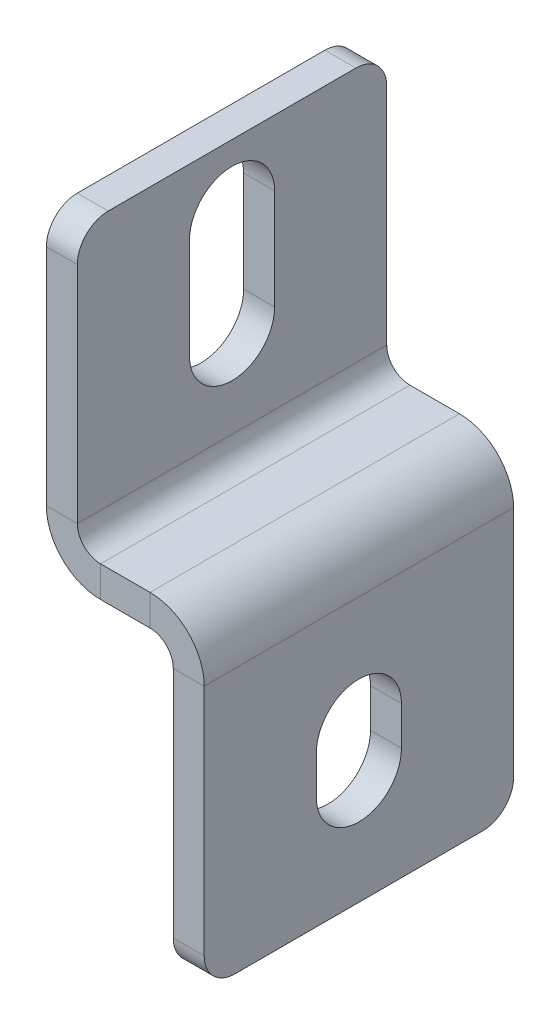
ISO-10303-21;
HEADER;
FILE_DESCRIPTION(('STEP AP214'),'2;1');
FILE_NAME('part.step','',(''),(''),'','','');
FILE_SCHEMA(('AUTOMOTIVE_DESIGN { 1 0 10303 214 1 1 1 1 }'));
ENDSEC;
DATA;
#1=APPLICATION_CONTEXT('core data for automotive mechanical design processes');
#2=APPLICATION_PROTOCOL_DEFINITION('international standard','automotive_design',2000,#1);
#3=PRODUCT_CONTEXT('',#1,'mechanical');
#4=PRODUCT('Part','Part','',(#3));
#5=PRODUCT_RELATED_PRODUCT_CATEGORY('part','',(#4));
#6=PRODUCT_DEFINITION_FORMATION('','',#4);
#7=PRODUCT_DEFINITION_CONTEXT('part definition',#1,'design');
#8=PRODUCT_DEFINITION('design','',#6,#7);
#9=PRODUCT_DEFINITION_SHAPE('','',#8);
#10=(LENGTH_UNIT() NAMED_UNIT(*) SI_UNIT(.MILLI.,.METRE.));
#11=(NAMED_UNIT(*) PLANE_ANGLE_UNIT() SI_UNIT($,.RADIAN.));
#12=(NAMED_UNIT(*) SI_UNIT($,.STERADIAN.) SOLID_ANGLE_UNIT());
#13=UNCERTAINTY_MEASURE_WITH_UNIT(LENGTH_MEASURE(1.E-05),#10,'distance_accuracy_value','');
#14=(GEOMETRIC_REPRESENTATION_CONTEXT(3) GLOBAL_UNCERTAINTY_ASSIGNED_CONTEXT((#13)) GLOBAL_UNIT_ASSIGNED_CONTEXT((#10,
#11,#12)) REPRESENTATION_CONTEXT('',''));
#15=CARTESIAN_POINT('',(0.,0.,0.));
#16=DIRECTION('',(0.,0.,1.));
#17=DIRECTION('',(1.,0.,0.));
#18=AXIS2_PLACEMENT_3D('',#15,#16,#17);
#19=CARTESIAN_POINT('',(3.56718446849537,-9.55865168971359,1.79187210233886));
#20=DIRECTION('',(0.,0.,-1.));
#21=DIRECTION('',(0.,-1.,0.));
#22=AXIS2_PLACEMENT_3D('',#19,#20,#21);
#23=PLANE('',#22);
#24=DIRECTION('',(1.,0.,0.));
#25=VECTOR('',#24,1.);
#26=CARTESIAN_POINT('',(3.56718446849537,-9.55865168971359,1.79187210233886));
#27=LINE('',#26,#25);
#28=CARTESIAN_POINT('',(1.56718446849536,-9.55865168971359,1.79187210233886));
#29=VERTEX_POINT('',#28);
#30=CARTESIAN_POINT('',(3.56718446849537,-9.55865168971359,1.79187210233886));
#31=VERTEX_POINT('',#30);
#32=EDGE_CURVE('E205',#29,#31,#27,.T.);
#33=ORIENTED_EDGE('',*,*,#32,.F.);
#34=DIRECTION('',(0.,-1.,0.));
#35=VECTOR('',#34,1.);
#36=CARTESIAN_POINT('',(1.56718446849536,3.79134831028641,1.79187210233886));
#37=LINE('',#36,#35);
#38=CARTESIAN_POINT('',(1.56718446849536,-7.05865168971359,1.79187210233886));
#39=VERTEX_POINT('',#38);
#40=EDGE_CURVE('E325',#39,#29,#37,.T.);
#41=ORIENTED_EDGE('',*,*,#40,.F.);
#42=DIRECTION('',(1.,0.,0.));
#43=VECTOR('',#42,1.);
#44=CARTESIAN_POINT('',(3.56718446849537,-7.05865168971359,1.79187210233886));
#45=LINE('',#44,#43);
#46=CARTESIAN_POINT('',(3.56718446849537,-7.05865168971359,1.79187210233886));
#47=VERTEX_POINT('',#46);
#48=EDGE_CURVE('E354',#39,#47,#45,.T.);
#49=ORIENTED_EDGE('',*,*,#48,.T.);
#50=DIRECTION('',(0.,-1.,0.));
#51=VECTOR('',#50,1.);
#52=CARTESIAN_POINT('',(3.56718446849537,-9.55865168971359,1.79187210233886));
#53=LINE('',#52,#51);
#54=EDGE_CURVE('E206',#47,#31,#53,.T.);
#55=ORIENTED_EDGE('',*,*,#54,.T.);
#56=EDGE_LOOP('',(#33,#41,#49,#55));
#57=FACE_BOUND('',#56,.T.);
#58=ADVANCED_FACE('F16',(#57),#23,.T.);
#59=CARTESIAN_POINT('',(3.56718446849537,-7.05865168971359,-0.95812789766115));
#60=DIRECTION('',(-1.,0.,0.));
#61=DIRECTION('',(0.,-1.,0.));
#62=AXIS2_PLACEMENT_3D('',#59,#60,#61);
#63=CYLINDRICAL_SURFACE('',#62,2.75);
#64=ORIENTED_EDGE('',*,*,#48,.F.);
#65=CARTESIAN_POINT('',(1.56718446849537,-7.05865168971359,-0.95812789766115));
#66=DIRECTION('',(1.,0.,0.));
#67=DIRECTION('',(0.,1.,0.));
#68=AXIS2_PLACEMENT_3D('',#65,#66,#67);
#69=CIRCLE('',#68,2.75);
#70=CARTESIAN_POINT('',(1.56718446849536,-7.05865168971359,-3.70812789766115));
#71=VERTEX_POINT('',#70);
#72=EDGE_CURVE('E311',#71,#39,#69,.T.);
#73=ORIENTED_EDGE('',*,*,#72,.F.);
#74=DIRECTION('',(1.,0.,0.));
#75=VECTOR('',#74,1.);
#76=CARTESIAN_POINT('',(3.56718446849537,-7.05865168971359,-3.70812789766115));
#77=LINE('',#76,#75);
#78=CARTESIAN_POINT('',(3.56718446849537,-7.05865168971359,-3.70812789766115));
#79=VERTEX_POINT('',#78);
#80=EDGE_CURVE('E190',#71,#79,#77,.T.);
#81=ORIENTED_EDGE('',*,*,#80,.T.);
#82=CARTESIAN_POINT('',(3.56718446849537,-7.05865168971359,-0.95812789766115));
#83=DIRECTION('',(1.,0.,0.));
#84=DIRECTION('',(0.,1.,0.));
#85=AXIS2_PLACEMENT_3D('',#82,#83,#84);
#86=CIRCLE('',#85,2.75);
#87=EDGE_CURVE('E201',#79,#47,#86,.T.);
#88=ORIENTED_EDGE('',*,*,#87,.T.);
#89=EDGE_LOOP('',(#64,#73,#81,#88));
#90=FACE_BOUND('',#89,.T.);
#91=ADVANCED_FACE('F489',(#90),#63,.F.);
#92=CARTESIAN_POINT('',(3.56718446849537,-9.55865168971359,-3.70812789766115));
#93=DIRECTION('',(0.,0.,1.));
#94=DIRECTION('',(0.,1.,0.));
#95=AXIS2_PLACEMENT_3D('',#92,#93,#94);
#96=PLANE('',#95);
#97=ORIENTED_EDGE('',*,*,#80,.F.);
#98=DIRECTION('',(0.,-1.,0.));
#99=VECTOR('',#98,1.);
#100=CARTESIAN_POINT('',(1.56718446849536,3.79134831028641,-3.70812789766115));
#101=LINE('',#100,#99);
#102=CARTESIAN_POINT('',(1.56718446849536,-9.55865168971359,-3.70812789766115));
#103=VERTEX_POINT('',#102);
#104=EDGE_CURVE('E185',#103,#71,#101,.F.);
#105=ORIENTED_EDGE('',*,*,#104,.F.);
#106=DIRECTION('',(1.,0.,0.));
#107=VECTOR('',#106,1.);
#108=CARTESIAN_POINT('',(3.56718446849536,-9.55865168971359,-3.70812789766115));
#109=LINE('',#108,#107);
#110=CARTESIAN_POINT('',(3.56718446849536,-9.55865168971359,-3.70812789766115));
#111=VERTEX_POINT('',#110);
#112=EDGE_CURVE('E179',#103,#111,#109,.T.);
#113=ORIENTED_EDGE('',*,*,#112,.T.);
#114=DIRECTION('',(0.,1.,0.));
#115=VECTOR('',#114,1.);
#116=CARTESIAN_POINT('',(3.56718446849537,-9.55865168971359,-3.70812789766115));
#117=LINE('',#116,#115);
#118=EDGE_CURVE('E182',#111,#79,#117,.T.);
#119=ORIENTED_EDGE('',*,*,#118,.T.);
#120=EDGE_LOOP('',(#97,#105,#113,#119));
#121=FACE_BOUND('',#120,.T.);
#122=ADVANCED_FACE('F181',(#121),#96,.T.);
#123=CARTESIAN_POINT('',(-4.63281553150464,3.79134831028641,9.04187210233886));
#124=DIRECTION('',(0.,0.,1.));
#125=DIRECTION('',(-1.,0.,0.));
#126=AXIS2_PLACEMENT_3D('',#123,#124,#125);
#127=PLANE('',#126);
#128=DIRECTION('',(0.,1.,0.));
#129=VECTOR('',#128,1.);
#130=CARTESIAN_POINT('',(-3.13281553150464,3.79134831028641,9.04187210233886));
#131=LINE('',#130,#129);
#132=CARTESIAN_POINT('',(-3.13281553150464,1.79134831028641,9.04187210233886));
#133=VERTEX_POINT('',#132);
#134=CARTESIAN_POINT('',(-3.13281553150464,3.79134831028641,9.04187210233886));
#135=VERTEX_POINT('',#134);
#136=EDGE_CURVE('E191',#133,#135,#131,.T.);
#137=ORIENTED_EDGE('',*,*,#136,.F.);
#138=DIRECTION('',(1.,0.,0.));
#139=VECTOR('',#138,1.);
#140=CARTESIAN_POINT('',(-4.63281553150464,1.79134831028641,9.04187210233886));
#141=LINE('',#140,#139);
#142=CARTESIAN_POINT('',(0.0671844684953576,1.79134831028641,9.04187210233886));
#143=VERTEX_POINT('',#142);
#144=EDGE_CURVE('E303',#143,#133,#141,.F.);
#145=ORIENTED_EDGE('',*,*,#144,.F.);
#146=DIRECTION('',(0.,1.,0.));
#147=VECTOR('',#146,1.);
#148=CARTESIAN_POINT('',(0.0671844684953576,3.79134831028641,9.04187210233886));
#149=LINE('',#148,#147);
#150=CARTESIAN_POINT('',(0.0671844684953576,3.79134831028641,9.04187210233886));
#151=VERTEX_POINT('',#150);
#152=EDGE_CURVE('E349',#143,#151,#149,.T.);
#153=ORIENTED_EDGE('',*,*,#152,.T.);
#154=DIRECTION('',(-1.,0.,0.));
#155=VECTOR('',#154,1.);
#156=CARTESIAN_POINT('',(-4.63281553150464,3.79134831028641,9.04187210233886));
#157=LINE('',#156,#155);
#158=EDGE_CURVE('E202',#151,#135,#157,.T.);
#159=ORIENTED_EDGE('',*,*,#158,.T.);
#160=EDGE_LOOP('',(#137,#145,#153,#159));
#161=FACE_BOUND('',#160,.T.);
#162=ADVANCED_FACE('F417',(#161),#127,.T.);
#163=CARTESIAN_POINT('',(0.0671844684953576,0.291348310286411,9.04187210233886));
#164=DIRECTION('',(0.,0.,-1.));
#165=DIRECTION('',(-1.,0.,0.));
#166=AXIS2_PLACEMENT_3D('',#163,#164,#165);
#167=PLANE('',#166);
#168=ORIENTED_EDGE('',*,*,#152,.F.);
#169=CARTESIAN_POINT('',(0.0671844684953576,0.291348310286411,9.04187210233886));
#170=DIRECTION('',(0.,0.,-1.));
#171=DIRECTION('',(-1.,0.,0.));
#172=AXIS2_PLACEMENT_3D('',#169,#170,#171);
#173=CIRCLE('',#172,1.5);
#174=CARTESIAN_POINT('',(1.56718446849536,0.291348310286412,9.04187210233886));
#175=VERTEX_POINT('',#174);
#176=EDGE_CURVE('E304',#143,#175,#173,.T.);
#177=ORIENTED_EDGE('',*,*,#176,.T.);
#178=DIRECTION('',(1.,0.,0.));
#179=VECTOR('',#178,1.);
#180=CARTESIAN_POINT('',(3.56718446849536,0.291348310286412,9.04187210233886));
#181=LINE('',#180,#179);
#182=CARTESIAN_POINT('',(3.56718446849536,0.291348310286412,9.04187210233886));
#183=VERTEX_POINT('',#182);
#184=EDGE_CURVE('E346',#175,#183,#181,.T.);
#185=ORIENTED_EDGE('',*,*,#184,.T.);
#186=CARTESIAN_POINT('',(0.0671844684953576,0.291348310286411,9.04187210233886));
#187=DIRECTION('',(0.,0.,1.));
#188=DIRECTION('',(1.,0.,0.));
#189=AXIS2_PLACEMENT_3D('',#186,#187,#188);
#190=CIRCLE('',#189,3.5);
#191=EDGE_CURVE('E248',#151,#183,#190,.F.);
#192=ORIENTED_EDGE('',*,*,#191,.F.);
#193=EDGE_LOOP('',(#168,#177,#185,#192));
#194=FACE_BOUND('',#193,.T.);
#195=ADVANCED_FACE('F450',(#194),#167,.F.);
#196=CARTESIAN_POINT('',(3.56718446849536,3.79134831028641,9.04187210233886));
#197=DIRECTION('',(0.,0.,1.));
#198=DIRECTION('',(0.,1.,0.));
#199=AXIS2_PLACEMENT_3D('',#196,#197,#198);
#200=PLANE('',#199);
#201=DIRECTION('',(0.,-1.,0.));
#202=VECTOR('',#201,1.);
#203=CARTESIAN_POINT('',(1.56718446849536,3.79134831028641,9.04187210233886));
#204=LINE('',#203,#202);
#205=CARTESIAN_POINT('',(1.56718446849536,-14.8086516897136,9.04187210233886));
#206=VERTEX_POINT('',#205);
#207=EDGE_CURVE('E310',#206,#175,#204,.F.);
#208=ORIENTED_EDGE('',*,*,#207,.F.);
#209=DIRECTION('',(-1.,0.,0.));
#210=VECTOR('',#209,1.);
#211=CARTESIAN_POINT('',(3.56718446849536,-14.8086516897136,9.04187210233886));
#212=LINE('',#211,#210);
#213=CARTESIAN_POINT('',(3.56718446849536,-14.8086516897136,9.04187210233886));
#214=VERTEX_POINT('',#213);
#215=EDGE_CURVE('E372',#206,#214,#212,.F.);
#216=ORIENTED_EDGE('',*,*,#215,.T.);
#217=DIRECTION('',(0.,1.,0.));
#218=VECTOR('',#217,1.);
#219=CARTESIAN_POINT('',(3.56718446849536,3.79134831028641,9.04187210233886));
#220=LINE('',#219,#218);
#221=EDGE_CURVE('E214',#214,#183,#220,.T.);
#222=ORIENTED_EDGE('',*,*,#221,.T.);
#223=ORIENTED_EDGE('',*,*,#184,.F.);
#224=EDGE_LOOP('',(#208,#216,#222,#223));
#225=FACE_BOUND('',#224,.T.);
#226=ADVANCED_FACE('F478',(#225),#200,.T.);
#227=CARTESIAN_POINT('',(3.56718446849536,-16.8086516897136,9.04187210233886));
#228=DIRECTION('',(0.,1.,0.));
#229=DIRECTION('',(0.,0.,-1.));
#230=AXIS2_PLACEMENT_3D('',#227,#228,#229);
#231=PLANE('',#230);
#232=DIRECTION('',(0.,0.,1.));
#233=VECTOR('',#232,1.);
#234=CARTESIAN_POINT('',(1.56718446849536,-16.8086516897136,9.04187210233886));
#235=LINE('',#234,#233);
#236=CARTESIAN_POINT('',(1.56718446849536,-16.8086516897136,7.04187210233886));
#237=VERTEX_POINT('',#236);
#238=CARTESIAN_POINT('',(1.56718446849536,-16.8086516897136,-8.95812789766115));
#239=VERTEX_POINT('',#238);
#240=EDGE_CURVE('E281',#237,#239,#235,.F.);
#241=ORIENTED_EDGE('',*,*,#240,.T.);
#242=DIRECTION('',(-1.,0.,0.));
#243=VECTOR('',#242,1.);
#244=CARTESIAN_POINT('',(3.56718446849536,-16.8086516897136,-8.95812789766115));
#245=LINE('',#244,#243);
#246=CARTESIAN_POINT('',(3.56718446849536,-16.8086516897136,-8.95812789766115));
#247=VERTEX_POINT('',#246);
#248=EDGE_CURVE('E359',#239,#247,#245,.F.);
#249=ORIENTED_EDGE('',*,*,#248,.T.);
#250=DIRECTION('',(0.,0.,-1.));
#251=VECTOR('',#250,1.);
#252=CARTESIAN_POINT('',(3.56718446849536,-16.8086516897136,9.04187210233886));
#253=LINE('',#252,#251);
#254=CARTESIAN_POINT('',(3.56718446849536,-16.8086516897136,7.04187210233886));
#255=VERTEX_POINT('',#254);
#256=EDGE_CURVE('E216',#255,#247,#253,.T.);
#257=ORIENTED_EDGE('',*,*,#256,.F.);
#258=DIRECTION('',(1.,0.,0.));
#259=VECTOR('',#258,1.);
#260=CARTESIAN_POINT('',(3.56718446849536,-16.8086516897136,7.04187210233886));
#261=LINE('',#260,#259);
#262=EDGE_CURVE('E356',#255,#237,#261,.F.);
#263=ORIENTED_EDGE('',*,*,#262,.T.);
#264=EDGE_LOOP('',(#241,#249,#257,#263));
#265=FACE_BOUND('',#264,.T.);
#266=ADVANCED_FACE('F470',(#265),#231,.F.);
#267=CARTESIAN_POINT('',(3.56718446849536,3.79134831028641,-10.9581278976611));
#268=DIRECTION('',(0.,0.,1.));
#269=DIRECTION('',(0.,1.,0.));
#270=AXIS2_PLACEMENT_3D('',#267,#268,#269);
#271=PLANE('',#270);
#272=DIRECTION('',(0.,1.,0.));
#273=VECTOR('',#272,1.);
#274=CARTESIAN_POINT('',(3.56718446849536,3.79134831028641,-10.9581278976611));
#275=LINE('',#274,#273);
#276=CARTESIAN_POINT('',(3.56718446849536,-14.8086516897136,-10.9581278976611));
#277=VERTEX_POINT('',#276);
#278=CARTESIAN_POINT('',(3.56718446849536,0.291348310286412,-10.9581278976611));
#279=VERTEX_POINT('',#278);
#280=EDGE_CURVE('E212',#277,#279,#275,.T.);
#281=ORIENTED_EDGE('',*,*,#280,.F.);
#282=DIRECTION('',(-1.,0.,0.));
#283=VECTOR('',#282,1.);
#284=CARTESIAN_POINT('',(3.56718446849536,-14.8086516897136,-10.9581278976611));
#285=LINE('',#284,#283);
#286=CARTESIAN_POINT('',(1.56718446849536,-14.8086516897136,-10.9581278976611));
#287=VERTEX_POINT('',#286);
#288=EDGE_CURVE('E366',#277,#287,#285,.T.);
#289=ORIENTED_EDGE('',*,*,#288,.T.);
#290=DIRECTION('',(0.,-1.,0.));
#291=VECTOR('',#290,1.);
#292=CARTESIAN_POINT('',(1.56718446849536,3.79134831028641,-10.9581278976611));
#293=LINE('',#292,#291);
#294=CARTESIAN_POINT('',(1.56718446849536,0.291348310286412,-10.9581278976611));
#295=VERTEX_POINT('',#294);
#296=EDGE_CURVE('E308',#287,#295,#293,.F.);
#297=ORIENTED_EDGE('',*,*,#296,.T.);
#298=DIRECTION('',(1.,0.,0.));
#299=VECTOR('',#298,1.);
#300=CARTESIAN_POINT('',(3.56718446849536,0.291348310286412,-10.9581278976611));
#301=LINE('',#300,#299);
#302=EDGE_CURVE('E343',#295,#279,#301,.T.);
#303=ORIENTED_EDGE('',*,*,#302,.T.);
#304=EDGE_LOOP('',(#281,#289,#297,#303));
#305=FACE_BOUND('',#304,.T.);
#306=ADVANCED_FACE('F459',(#305),#271,.F.);
#307=CARTESIAN_POINT('',(0.0671844684953576,0.291348310286411,-10.9581278976611));
#308=DIRECTION('',(0.,0.,1.));
#309=DIRECTION('',(1.,0.,0.));
#310=AXIS2_PLACEMENT_3D('',#307,#308,#309);
#311=PLANE('',#310);
#312=ORIENTED_EDGE('',*,*,#302,.F.);
#313=CARTESIAN_POINT('',(0.0671844684953576,0.291348310286411,-10.9581278976611));
#314=DIRECTION('',(0.,0.,-1.));
#315=DIRECTION('',(-1.,0.,0.));
#316=AXIS2_PLACEMENT_3D('',#313,#314,#315);
#317=CIRCLE('',#316,1.5);
#318=CARTESIAN_POINT('',(0.0671844684953576,1.79134831028641,-10.9581278976611));
#319=VERTEX_POINT('',#318);
#320=EDGE_CURVE('E305',#295,#319,#317,.F.);
#321=ORIENTED_EDGE('',*,*,#320,.T.);
#322=DIRECTION('',(0.,1.,0.));
#323=VECTOR('',#322,1.);
#324=CARTESIAN_POINT('',(0.0671844684953576,3.79134831028641,-10.9581278976611));
#325=LINE('',#324,#323);
#326=CARTESIAN_POINT('',(0.0671844684953576,3.79134831028641,-10.9581278976611));
#327=VERTEX_POINT('',#326);
#328=EDGE_CURVE('E341',#319,#327,#325,.T.);
#329=ORIENTED_EDGE('',*,*,#328,.T.);
#330=CARTESIAN_POINT('',(0.0671844684953576,0.291348310286411,-10.9581278976611));
#331=DIRECTION('',(0.,0.,-1.));
#332=DIRECTION('',(-1.,0.,0.));
#333=AXIS2_PLACEMENT_3D('',#330,#331,#332);
#334=CIRCLE('',#333,3.5);
#335=EDGE_CURVE('E245',#279,#327,#334,.F.);
#336=ORIENTED_EDGE('',*,*,#335,.F.);
#337=EDGE_LOOP('',(#312,#321,#329,#336));
#338=FACE_BOUND('',#337,.T.);
#339=ADVANCED_FACE('F444',(#338),#311,.F.);
#340=CARTESIAN_POINT('',(-4.63281553150464,3.79134831028641,-10.9581278976611));
#341=DIRECTION('',(0.,0.,1.));
#342=DIRECTION('',(-1.,0.,0.));
#343=AXIS2_PLACEMENT_3D('',#340,#341,#342);
#344=PLANE('',#343);
#345=ORIENTED_EDGE('',*,*,#328,.F.);
#346=DIRECTION('',(1.,0.,0.));
#347=VECTOR('',#346,1.);
#348=CARTESIAN_POINT('',(-4.63281553150464,1.79134831028641,-10.9581278976611));
#349=LINE('',#348,#347);
#350=CARTESIAN_POINT('',(-3.13281553150464,1.79134831028641,-10.9581278976611));
#351=VERTEX_POINT('',#350);
#352=EDGE_CURVE('E300',#319,#351,#349,.F.);
#353=ORIENTED_EDGE('',*,*,#352,.T.);
#354=DIRECTION('',(0.,1.,0.));
#355=VECTOR('',#354,1.);
#356=CARTESIAN_POINT('',(-3.13281553150464,3.79134831028641,-10.9581278976611));
#357=LINE('',#356,#355);
#358=CARTESIAN_POINT('',(-3.13281553150464,3.79134831028641,-10.9581278976611));
#359=VERTEX_POINT('',#358);
#360=EDGE_CURVE('E339',#351,#359,#357,.T.);
#361=ORIENTED_EDGE('',*,*,#360,.T.);
#362=DIRECTION('',(-1.,0.,0.));
#363=VECTOR('',#362,1.);
#364=CARTESIAN_POINT('',(-4.63281553150464,3.79134831028641,-10.9581278976611));
#365=LINE('',#364,#363);
#366=EDGE_CURVE('E252',#327,#359,#365,.T.);
#367=ORIENTED_EDGE('',*,*,#366,.F.);
#368=EDGE_LOOP('',(#345,#353,#361,#367));
#369=FACE_BOUND('',#368,.T.);
#370=ADVANCED_FACE('F436',(#369),#344,.F.);
#371=CARTESIAN_POINT('',(-3.13281553150464,5.29134831028641,-10.9581278976611));
#372=DIRECTION('',(0.,0.,-1.));
#373=DIRECTION('',(-1.,0.,0.));
#374=AXIS2_PLACEMENT_3D('',#371,#372,#373);
#375=PLANE('',#374);
#376=ORIENTED_EDGE('',*,*,#360,.F.);
#377=CARTESIAN_POINT('',(-3.13281553150464,5.29134831028641,-10.9581278976611));
#378=DIRECTION('',(0.,0.,1.));
#379=DIRECTION('',(1.,0.,0.));
#380=AXIS2_PLACEMENT_3D('',#377,#378,#379);
#381=CIRCLE('',#380,3.5);
#382=CARTESIAN_POINT('',(-6.63281553150464,5.29134831028641,-10.9581278976611));
#383=VERTEX_POINT('',#382);
#384=EDGE_CURVE('E296',#351,#383,#381,.F.);
#385=ORIENTED_EDGE('',*,*,#384,.T.);
#386=DIRECTION('',(1.,0.,0.));
#387=VECTOR('',#386,1.);
#388=CARTESIAN_POINT('',(-4.63281553150464,5.29134831028641,-10.9581278976611));
#389=LINE('',#388,#387);
#390=CARTESIAN_POINT('',(-4.63281553150464,5.29134831028641,-10.9581278976611));
#391=VERTEX_POINT('',#390);
#392=EDGE_CURVE('E337',#383,#391,#389,.T.);
#393=ORIENTED_EDGE('',*,*,#392,.T.);
#394=CARTESIAN_POINT('',(-3.13281553150464,5.29134831028641,-10.9581278976611));
#395=DIRECTION('',(0.,0.,1.));
#396=DIRECTION('',(1.,0.,0.));
#397=AXIS2_PLACEMENT_3D('',#394,#395,#396);
#398=CIRCLE('',#397,1.5);
#399=EDGE_CURVE('E259',#359,#391,#398,.F.);
#400=ORIENTED_EDGE('',*,*,#399,.F.);
#401=EDGE_LOOP('',(#376,#385,#393,#400));
#402=FACE_BOUND('',#401,.T.);
#403=ADVANCED_FACE('F429',(#402),#375,.T.);
#404=CARTESIAN_POINT('',(-4.63281553150464,21.7913483102864,-10.9581278976611));
#405=DIRECTION('',(0.,0.,1.));
#406=DIRECTION('',(0.,1.,0.));
#407=AXIS2_PLACEMENT_3D('',#404,#405,#406);
#408=PLANE('',#407);
#409=DIRECTION('',(0.,-1.,0.));
#410=VECTOR('',#409,1.);
#411=CARTESIAN_POINT('',(-6.63281553150464,21.7913483102864,-10.9581278976611));
#412=LINE('',#411,#410);
#413=CARTESIAN_POINT('',(-6.63281553150464,19.7913483102864,-10.9581278976611));
#414=VERTEX_POINT('',#413);
#415=EDGE_CURVE('E285',#383,#414,#412,.F.);
#416=ORIENTED_EDGE('',*,*,#415,.T.);
#417=DIRECTION('',(1.,0.,0.));
#418=VECTOR('',#417,1.);
#419=CARTESIAN_POINT('',(-4.63281553150464,19.7913483102864,-10.9581278976611));
#420=LINE('',#419,#418);
#421=CARTESIAN_POINT('',(-4.63281553150464,19.7913483102864,-10.9581278976611));
#422=VERTEX_POINT('',#421);
#423=EDGE_CURVE('E375',#414,#422,#420,.T.);
#424=ORIENTED_EDGE('',*,*,#423,.T.);
#425=DIRECTION('',(0.,1.,0.));
#426=VECTOR('',#425,1.);
#427=CARTESIAN_POINT('',(-4.63281553150464,21.7913483102864,-10.9581278976611));
#428=LINE('',#427,#426);
#429=EDGE_CURVE('E231',#391,#422,#428,.T.);
#430=ORIENTED_EDGE('',*,*,#429,.F.);
#431=ORIENTED_EDGE('',*,*,#392,.F.);
#432=EDGE_LOOP('',(#416,#424,#430,#431));
#433=FACE_BOUND('',#432,.T.);
#434=ADVANCED_FACE('F395',(#433),#408,.F.);
#435=CARTESIAN_POINT('',(-4.63281553150464,21.7913483102864,9.04187210233886));
#436=DIRECTION('',(0.,1.,0.));
#437=DIRECTION('',(0.,0.,-1.));
#438=AXIS2_PLACEMENT_3D('',#435,#436,#437);
#439=PLANE('',#438);
#440=DIRECTION('',(0.,0.,-1.));
#441=VECTOR('',#440,1.);
#442=CARTESIAN_POINT('',(-4.63281553150464,21.7913483102864,9.04187210233886));
#443=LINE('',#442,#441);
#444=CARTESIAN_POINT('',(-4.63281553150464,21.7913483102864,7.04187210233886));
#445=VERTEX_POINT('',#444);
#446=CARTESIAN_POINT('',(-4.63281553150464,21.7913483102864,-8.95812789766115));
#447=VERTEX_POINT('',#446);
#448=EDGE_CURVE('E234',#445,#447,#443,.T.);
#449=ORIENTED_EDGE('',*,*,#448,.T.);
#450=DIRECTION('',(-1.,0.,0.));
#451=VECTOR('',#450,1.);
#452=CARTESIAN_POINT('',(-4.63281553150464,21.7913483102864,-8.95812789766115));
#453=LINE('',#452,#451);
#454=CARTESIAN_POINT('',(-6.63281553150464,21.7913483102864,-8.95812789766115));
#455=VERTEX_POINT('',#454);
#456=EDGE_CURVE('E37',#447,#455,#453,.T.);
#457=ORIENTED_EDGE('',*,*,#456,.T.);
#458=DIRECTION('',(0.,0.,1.));
#459=VECTOR('',#458,1.);
#460=CARTESIAN_POINT('',(-6.63281553150464,21.7913483102864,9.04187210233886));
#461=LINE('',#460,#459);
#462=CARTESIAN_POINT('',(-6.63281553150464,21.7913483102864,7.04187210233886));
#463=VERTEX_POINT('',#462);
#464=EDGE_CURVE('E292',#463,#455,#461,.F.);
#465=ORIENTED_EDGE('',*,*,#464,.F.);
#466=DIRECTION('',(1.,0.,0.));
#467=VECTOR('',#466,1.);
#468=CARTESIAN_POINT('',(-4.63281553150464,21.7913483102864,7.04187210233886));
#469=LINE('',#468,#467);
#470=EDGE_CURVE('E382',#463,#445,#469,.T.);
#471=ORIENTED_EDGE('',*,*,#470,.T.);
#472=EDGE_LOOP('',(#449,#457,#465,#471));
#473=FACE_BOUND('',#472,.T.);
#474=ADVANCED_FACE('F401',(#473),#439,.T.);
#475=CARTESIAN_POINT('',(-4.63281553150464,21.7913483102864,9.04187210233886));
#476=DIRECTION('',(0.,0.,1.));
#477=DIRECTION('',(0.,1.,0.));
#478=AXIS2_PLACEMENT_3D('',#475,#476,#477);
#479=PLANE('',#478);
#480=DIRECTION('',(0.,1.,0.));
#481=VECTOR('',#480,1.);
#482=CARTESIAN_POINT('',(-4.63281553150464,21.7913483102864,9.04187210233886));
#483=LINE('',#482,#481);
#484=CARTESIAN_POINT('',(-4.63281553150464,5.29134831028641,9.04187210233886));
#485=VERTEX_POINT('',#484);
#486=CARTESIAN_POINT('',(-4.63281553150464,19.7913483102864,9.04187210233886));
#487=VERTEX_POINT('',#486);
#488=EDGE_CURVE('E236',#485,#487,#483,.T.);
#489=ORIENTED_EDGE('',*,*,#488,.T.);
#490=DIRECTION('',(1.,0.,0.));
#491=VECTOR('',#490,1.);
#492=CARTESIAN_POINT('',(-4.63281553150464,19.7913483102864,9.04187210233886));
#493=LINE('',#492,#491);
#494=CARTESIAN_POINT('',(-6.63281553150464,19.7913483102864,9.04187210233886));
#495=VERTEX_POINT('',#494);
#496=EDGE_CURVE('E10',#487,#495,#493,.F.);
#497=ORIENTED_EDGE('',*,*,#496,.T.);
#498=DIRECTION('',(0.,-1.,0.));
#499=VECTOR('',#498,1.);
#500=CARTESIAN_POINT('',(-6.63281553150464,21.7913483102864,9.04187210233886));
#501=LINE('',#500,#499);
#502=CARTESIAN_POINT('',(-6.63281553150464,5.29134831028641,9.04187210233886));
#503=VERTEX_POINT('',#502);
#504=EDGE_CURVE('E274',#503,#495,#501,.F.);
#505=ORIENTED_EDGE('',*,*,#504,.F.);
#506=DIRECTION('',(1.,0.,0.));
#507=VECTOR('',#506,1.);
#508=CARTESIAN_POINT('',(-4.63281553150464,5.29134831028641,9.04187210233886));
#509=LINE('',#508,#507);
#510=EDGE_CURVE('E335',#503,#485,#509,.T.);
#511=ORIENTED_EDGE('',*,*,#510,.T.);
#512=EDGE_LOOP('',(#489,#497,#505,#511));
#513=FACE_BOUND('',#512,.T.);
#514=ADVANCED_FACE('F407',(#513),#479,.T.);
#515=CARTESIAN_POINT('',(-4.63281553150464,21.7913483102864,-3.70812789766114));
#516=DIRECTION('',(0.,0.,-1.));
#517=DIRECTION('',(0.,-1.,0.));
#518=AXIS2_PLACEMENT_3D('',#515,#516,#517);
#519=PLANE('',#518);
#520=DIRECTION('',(1.,0.,0.));
#521=VECTOR('',#520,1.);
#522=CARTESIAN_POINT('',(-4.63281553150464,17.5413483102864,-3.70812789766114));
#523=LINE('',#522,#521);
#524=CARTESIAN_POINT('',(-6.63281553150464,17.5413483102864,-3.70812789766114));
#525=VERTEX_POINT('',#524);
#526=CARTESIAN_POINT('',(-4.63281553150464,17.5413483102864,-3.70812789766114));
#527=VERTEX_POINT('',#526);
#528=EDGE_CURVE('E333',#525,#527,#523,.T.);
#529=ORIENTED_EDGE('',*,*,#528,.F.);
#530=DIRECTION('',(0.,-1.,0.));
#531=VECTOR('',#530,1.);
#532=CARTESIAN_POINT('',(-6.63281553150464,21.7913483102864,-3.70812789766114));
#533=LINE('',#532,#531);
#534=CARTESIAN_POINT('',(-6.63281553150464,11.0413483102864,-3.70812789766115));
#535=VERTEX_POINT('',#534);
#536=EDGE_CURVE('E286',#525,#535,#533,.T.);
#537=ORIENTED_EDGE('',*,*,#536,.T.);
#538=DIRECTION('',(1.,0.,0.));
#539=VECTOR('',#538,1.);
#540=CARTESIAN_POINT('',(-4.63281553150464,11.0413483102864,-3.70812789766114));
#541=LINE('',#540,#539);
#542=CARTESIAN_POINT('',(-4.63281553150464,11.0413483102864,-3.70812789766114));
#543=VERTEX_POINT('',#542);
#544=EDGE_CURVE('E331',#535,#543,#541,.T.);
#545=ORIENTED_EDGE('',*,*,#544,.T.);
#546=DIRECTION('',(0.,-1.,0.));
#547=VECTOR('',#546,1.);
#548=CARTESIAN_POINT('',(-4.63281553150464,21.7913483102864,-3.70812789766114));
#549=LINE('',#548,#547);
#550=EDGE_CURVE('E225',#527,#543,#549,.T.);
#551=ORIENTED_EDGE('',*,*,#550,.F.);
#552=EDGE_LOOP('',(#529,#537,#545,#551));
#553=FACE_BOUND('',#552,.T.);
#554=ADVANCED_FACE('F658',(#553),#519,.F.);
#555=CARTESIAN_POINT('',(-4.63281553150464,11.0413483102864,-0.958127897661145));
#556=DIRECTION('',(-1.,0.,0.));
#557=DIRECTION('',(0.,-1.,0.));
#558=AXIS2_PLACEMENT_3D('',#555,#556,#557);
#559=CYLINDRICAL_SURFACE('',#558,2.75);
#560=ORIENTED_EDGE('',*,*,#544,.F.);
#561=CARTESIAN_POINT('',(-6.63281553150464,11.0413483102864,-0.958127897661145));
#562=DIRECTION('',(-1.,0.,0.));
#563=DIRECTION('',(0.,-1.,0.));
#564=AXIS2_PLACEMENT_3D('',#561,#562,#563);
#565=CIRCLE('',#564,2.75);
#566=CARTESIAN_POINT('',(-6.63281553150464,11.0413483102864,1.79187210233885));
#567=VERTEX_POINT('',#566);
#568=EDGE_CURVE('E282',#535,#567,#565,.T.);
#569=ORIENTED_EDGE('',*,*,#568,.T.);
#570=DIRECTION('',(1.,0.,0.));
#571=VECTOR('',#570,1.);
#572=CARTESIAN_POINT('',(-4.63281553150464,11.0413483102864,1.79187210233885));
#573=LINE('',#572,#571);
#574=CARTESIAN_POINT('',(-4.63281553150464,11.0413483102864,1.79187210233885));
#575=VERTEX_POINT('',#574);
#576=EDGE_CURVE('E329',#567,#575,#573,.T.);
#577=ORIENTED_EDGE('',*,*,#576,.T.);
#578=CARTESIAN_POINT('',(-4.63281553150464,11.0413483102864,-0.958127897661145));
#579=DIRECTION('',(-1.,0.,0.));
#580=DIRECTION('',(0.,-1.,0.));
#581=AXIS2_PLACEMENT_3D('',#578,#579,#580);
#582=CIRCLE('',#581,2.75);
#583=EDGE_CURVE('E228',#543,#575,#582,.T.);
#584=ORIENTED_EDGE('',*,*,#583,.F.);
#585=EDGE_LOOP('',(#560,#569,#577,#584));
#586=FACE_BOUND('',#585,.T.);
#587=ADVANCED_FACE('F648',(#586),#559,.F.);
#588=CARTESIAN_POINT('',(-4.63281553150464,21.7913483102864,1.79187210233886));
#589=DIRECTION('',(0.,0.,1.));
#590=DIRECTION('',(0.,1.,0.));
#591=AXIS2_PLACEMENT_3D('',#588,#589,#590);
#592=PLANE('',#591);
#593=ORIENTED_EDGE('',*,*,#576,.F.);
#594=DIRECTION('',(0.,-1.,0.));
#595=VECTOR('',#594,1.);
#596=CARTESIAN_POINT('',(-6.63281553150464,21.7913483102864,1.79187210233885));
#597=LINE('',#596,#595);
#598=CARTESIAN_POINT('',(-6.63281553150464,17.5413483102864,1.79187210233885));
#599=VERTEX_POINT('',#598);
#600=EDGE_CURVE('E277',#567,#599,#597,.F.);
#601=ORIENTED_EDGE('',*,*,#600,.T.);
#602=DIRECTION('',(1.,0.,0.));
#603=VECTOR('',#602,1.);
#604=CARTESIAN_POINT('',(-4.63281553150464,17.5413483102864,1.79187210233885));
#605=LINE('',#604,#603);
#606=CARTESIAN_POINT('',(-4.63281553150464,17.5413483102864,1.79187210233885));
#607=VERTEX_POINT('',#606);
#608=EDGE_CURVE('E258',#599,#607,#605,.T.);
#609=ORIENTED_EDGE('',*,*,#608,.T.);
#610=DIRECTION('',(0.,1.,0.));
#611=VECTOR('',#610,1.);
#612=CARTESIAN_POINT('',(-4.63281553150464,21.7913483102864,1.79187210233886));
#613=LINE('',#612,#611);
#614=EDGE_CURVE('E219',#575,#607,#613,.T.);
#615=ORIENTED_EDGE('',*,*,#614,.F.);
#616=EDGE_LOOP('',(#593,#601,#609,#615));
#617=FACE_BOUND('',#616,.T.);
#618=ADVANCED_FACE('F502',(#617),#592,.F.);
#619=CARTESIAN_POINT('',(3.56718446849537,-9.55865168971359,-0.95812789766115));
#620=DIRECTION('',(-1.,0.,0.));
#621=DIRECTION('',(0.,-1.,0.));
#622=AXIS2_PLACEMENT_3D('',#619,#620,#621);
#623=CYLINDRICAL_SURFACE('',#622,2.75);
#624=CARTESIAN_POINT('',(1.56718446849537,-9.55865168971359,-0.95812789766115));
#625=DIRECTION('',(1.,0.,0.));
#626=DIRECTION('',(0.,1.,0.));
#627=AXIS2_PLACEMENT_3D('',#624,#625,#626);
#628=CIRCLE('',#627,2.75);
#629=EDGE_CURVE('E322',#29,#103,#628,.T.);
#630=ORIENTED_EDGE('',*,*,#629,.F.);
#631=ORIENTED_EDGE('',*,*,#32,.T.);
#632=CARTESIAN_POINT('',(3.56718446849537,-9.55865168971359,-0.95812789766115));
#633=DIRECTION('',(1.,0.,0.));
#634=DIRECTION('',(0.,1.,0.));
#635=AXIS2_PLACEMENT_3D('',#632,#633,#634);
#636=CIRCLE('',#635,2.75);
#637=EDGE_CURVE('E198',#31,#111,#636,.T.);
#638=ORIENTED_EDGE('',*,*,#637,.T.);
#639=ORIENTED_EDGE('',*,*,#112,.F.);
#640=EDGE_LOOP('',(#630,#631,#638,#639));
#641=FACE_BOUND('',#640,.T.);
#642=ADVANCED_FACE('F204',(#641),#623,.F.);
#643=CARTESIAN_POINT('',(-4.63281553150464,17.5413483102864,-0.958127897661145));
#644=DIRECTION('',(-1.,0.,0.));
#645=DIRECTION('',(0.,-1.,0.));
#646=AXIS2_PLACEMENT_3D('',#643,#644,#645);
#647=CYLINDRICAL_SURFACE('',#646,2.75);
#648=CARTESIAN_POINT('',(-6.63281553150464,17.5413483102864,-0.958127897661145));
#649=DIRECTION('',(-1.,0.,0.));
#650=DIRECTION('',(0.,-1.,0.));
#651=AXIS2_PLACEMENT_3D('',#648,#649,#650);
#652=CIRCLE('',#651,2.75);
#653=EDGE_CURVE('E280',#599,#525,#652,.T.);
#654=ORIENTED_EDGE('',*,*,#653,.T.);
#655=ORIENTED_EDGE('',*,*,#528,.T.);
#656=CARTESIAN_POINT('',(-4.63281553150464,17.5413483102864,-0.958127897661145));
#657=DIRECTION('',(-1.,0.,0.));
#658=DIRECTION('',(0.,-1.,0.));
#659=AXIS2_PLACEMENT_3D('',#656,#657,#658);
#660=CIRCLE('',#659,2.75);
#661=EDGE_CURVE('E222',#607,#527,#660,.T.);
#662=ORIENTED_EDGE('',*,*,#661,.F.);
#663=ORIENTED_EDGE('',*,*,#608,.F.);
#664=EDGE_LOOP('',(#654,#655,#662,#663));
#665=FACE_BOUND('',#664,.T.);
#666=ADVANCED_FACE('F501',(#665),#647,.F.);
#667=CARTESIAN_POINT('',(-3.13281553150464,5.29134831028641,9.04187210233886));
#668=DIRECTION('',(0.,0.,1.));
#669=DIRECTION('',(1.,0.,0.));
#670=AXIS2_PLACEMENT_3D('',#667,#668,#669);
#671=PLANE('',#670);
#672=CARTESIAN_POINT('',(-3.13281553150464,5.29134831028641,9.04187210233886));
#673=DIRECTION('',(0.,0.,1.));
#674=DIRECTION('',(1.,0.,0.));
#675=AXIS2_PLACEMENT_3D('',#672,#673,#674);
#676=CIRCLE('',#675,3.5);
#677=EDGE_CURVE('E299',#503,#133,#676,.T.);
#678=ORIENTED_EDGE('',*,*,#677,.T.);
#679=ORIENTED_EDGE('',*,*,#136,.T.);
#680=CARTESIAN_POINT('',(-3.13281553150464,5.29134831028641,9.04187210233886));
#681=DIRECTION('',(0.,0.,-1.));
#682=DIRECTION('',(-1.,0.,0.));
#683=AXIS2_PLACEMENT_3D('',#680,#681,#682);
#684=CIRCLE('',#683,1.5);
#685=EDGE_CURVE('E249',#485,#135,#684,.F.);
#686=ORIENTED_EDGE('',*,*,#685,.F.);
#687=ORIENTED_EDGE('',*,*,#510,.F.);
#688=EDGE_LOOP('',(#678,#679,#686,#687));
#689=FACE_BOUND('',#688,.T.);
#690=ADVANCED_FACE('F410',(#689),#671,.T.);
#691=CARTESIAN_POINT('',(-4.63281553150464,21.7913483102864,9.04187210233886));
#692=DIRECTION('',(-1.,0.,0.));
#693=DIRECTION('',(0.,-1.,0.));
#694=AXIS2_PLACEMENT_3D('',#691,#692,#693);
#695=PLANE('',#694);
#696=ORIENTED_EDGE('',*,*,#614,.T.);
#697=ORIENTED_EDGE('',*,*,#661,.T.);
#698=ORIENTED_EDGE('',*,*,#550,.T.);
#699=ORIENTED_EDGE('',*,*,#583,.T.);
#700=EDGE_LOOP('',(#696,#697,#698,#699));
#701=FACE_BOUND('',#700,.T.);
#702=ORIENTED_EDGE('',*,*,#429,.T.);
#703=CARTESIAN_POINT('',(-4.63281553150464,19.7913483102864,-8.95812789766114));
#704=DIRECTION('',(-1.,0.,0.));
#705=DIRECTION('',(0.,-1.,0.));
#706=AXIS2_PLACEMENT_3D('',#703,#704,#705);
#707=CIRCLE('',#706,2.);
#708=EDGE_CURVE('E380',#422,#447,#707,.F.);
#709=ORIENTED_EDGE('',*,*,#708,.T.);
#710=ORIENTED_EDGE('',*,*,#448,.F.);
#711=CARTESIAN_POINT('',(-4.63281553150464,19.7913483102864,7.04187210233886));
#712=DIRECTION('',(-1.,0.,0.));
#713=DIRECTION('',(0.,-1.,0.));
#714=AXIS2_PLACEMENT_3D('',#711,#712,#713);
#715=CIRCLE('',#714,2.);
#716=EDGE_CURVE('E378',#445,#487,#715,.F.);
#717=ORIENTED_EDGE('',*,*,#716,.T.);
#718=ORIENTED_EDGE('',*,*,#488,.F.);
#719=DIRECTION('',(0.,0.,-1.));
#720=VECTOR('',#719,1.);
#721=CARTESIAN_POINT('',(-4.63281553150464,5.29134831028641,-10.9581278976611));
#722=LINE('',#721,#720);
#723=EDGE_CURVE('E244',#485,#391,#722,.T.);
#724=ORIENTED_EDGE('',*,*,#723,.T.);
#725=EDGE_LOOP('',(#702,#709,#710,#717,#718,#724));
#726=FACE_BOUND('',#725,.T.);
#727=ADVANCED_FACE('F400',(#701,#726),#695,.F.);
#728=CARTESIAN_POINT('',(3.56718446849536,3.79134831028641,9.04187210233886));
#729=DIRECTION('',(-1.,0.,0.));
#730=DIRECTION('',(0.,-1.,0.));
#731=AXIS2_PLACEMENT_3D('',#728,#729,#730);
#732=PLANE('',#731);
#733=ORIENTED_EDGE('',*,*,#118,.F.);
#734=ORIENTED_EDGE('',*,*,#637,.F.);
#735=ORIENTED_EDGE('',*,*,#54,.F.);
#736=ORIENTED_EDGE('',*,*,#87,.F.);
#737=EDGE_LOOP('',(#733,#734,#735,#736));
#738=FACE_BOUND('',#737,.T.);
#739=ORIENTED_EDGE('',*,*,#256,.T.);
#740=CARTESIAN_POINT('',(3.56718446849536,-14.8086516897136,-8.95812789766115));
#741=DIRECTION('',(-1.,0.,0.));
#742=DIRECTION('',(0.,-1.,0.));
#743=AXIS2_PLACEMENT_3D('',#740,#741,#742);
#744=CIRCLE('',#743,2.);
#745=EDGE_CURVE('E364',#247,#277,#744,.F.);
#746=ORIENTED_EDGE('',*,*,#745,.T.);
#747=ORIENTED_EDGE('',*,*,#280,.T.);
#748=DIRECTION('',(0.,0.,-1.));
#749=VECTOR('',#748,1.);
#750=CARTESIAN_POINT('',(3.56718446849536,0.291348310286411,9.04187210233886));
#751=LINE('',#750,#749);
#752=EDGE_CURVE('E241',#279,#183,#751,.F.);
#753=ORIENTED_EDGE('',*,*,#752,.T.);
#754=ORIENTED_EDGE('',*,*,#221,.F.);
#755=CARTESIAN_POINT('',(3.56718446849536,-14.8086516897136,7.04187210233886));
#756=DIRECTION('',(-1.,0.,0.));
#757=DIRECTION('',(0.,-1.,0.));
#758=AXIS2_PLACEMENT_3D('',#755,#756,#757);
#759=CIRCLE('',#758,2.);
#760=EDGE_CURVE('E362',#214,#255,#759,.F.);
#761=ORIENTED_EDGE('',*,*,#760,.T.);
#762=EDGE_LOOP('',(#739,#746,#747,#753,#754,#761));
#763=FACE_BOUND('',#762,.T.);
#764=ADVANCED_FACE('F195',(#738,#763),#732,.F.);
#765=CARTESIAN_POINT('',(-4.63281553150464,3.79134831028641,9.04187210233886));
#766=DIRECTION('',(0.,-1.,0.));
#767=DIRECTION('',(0.,0.,-1.));
#768=AXIS2_PLACEMENT_3D('',#765,#766,#767);
#769=PLANE('',#768);
#770=ORIENTED_EDGE('',*,*,#366,.T.);
#771=DIRECTION('',(0.,0.,-1.));
#772=VECTOR('',#771,1.);
#773=CARTESIAN_POINT('',(-3.13281553150464,3.79134831028641,9.04187210233886));
#774=LINE('',#773,#772);
#775=EDGE_CURVE('E255',#359,#135,#774,.F.);
#776=ORIENTED_EDGE('',*,*,#775,.T.);
#777=ORIENTED_EDGE('',*,*,#158,.F.);
#778=DIRECTION('',(0.,0.,-1.));
#779=VECTOR('',#778,1.);
#780=CARTESIAN_POINT('',(0.0671844684953576,3.79134831028641,9.04187210233886));
#781=LINE('',#780,#779);
#782=EDGE_CURVE('E238',#151,#327,#781,.T.);
#783=ORIENTED_EDGE('',*,*,#782,.T.);
#784=EDGE_LOOP('',(#770,#776,#777,#783));
#785=FACE_BOUND('',#784,.T.);
#786=ADVANCED_FACE('F422',(#785),#769,.F.);
#787=CARTESIAN_POINT('',(0.0671844684953576,0.291348310286411,9.04187210233886));
#788=DIRECTION('',(0.,0.,-1.));
#789=DIRECTION('',(-1.,0.,0.));
#790=AXIS2_PLACEMENT_3D('',#787,#788,#789);
#791=CYLINDRICAL_SURFACE('',#790,3.5);
#792=ORIENTED_EDGE('',*,*,#191,.T.);
#793=ORIENTED_EDGE('',*,*,#752,.F.);
#794=ORIENTED_EDGE('',*,*,#335,.T.);
#795=ORIENTED_EDGE('',*,*,#782,.F.);
#796=EDGE_LOOP('',(#792,#793,#794,#795));
#797=FACE_BOUND('',#796,.T.);
#798=ADVANCED_FACE('F454',(#797),#791,.T.);
#799=CARTESIAN_POINT('',(-3.13281553150464,5.29134831028641,9.04187210233886));
#800=DIRECTION('',(0.,0.,1.));
#801=DIRECTION('',(1.,0.,0.));
#802=AXIS2_PLACEMENT_3D('',#799,#800,#801);
#803=CYLINDRICAL_SURFACE('',#802,1.5);
#804=ORIENTED_EDGE('',*,*,#685,.T.);
#805=ORIENTED_EDGE('',*,*,#775,.F.);
#806=ORIENTED_EDGE('',*,*,#399,.T.);
#807=ORIENTED_EDGE('',*,*,#723,.F.);
#808=EDGE_LOOP('',(#804,#805,#806,#807));
#809=FACE_BOUND('',#808,.T.);
#810=ADVANCED_FACE('F414',(#809),#803,.F.);
#811=CARTESIAN_POINT('',(-6.63281553150464,21.7913483102864,9.04187210233886));
#812=DIRECTION('',(-1.,0.,0.));
#813=DIRECTION('',(0.,-1.,0.));
#814=AXIS2_PLACEMENT_3D('',#811,#812,#813);
#815=PLANE('',#814);
#816=ORIENTED_EDGE('',*,*,#600,.F.);
#817=ORIENTED_EDGE('',*,*,#568,.F.);
#818=ORIENTED_EDGE('',*,*,#536,.F.);
#819=ORIENTED_EDGE('',*,*,#653,.F.);
#820=EDGE_LOOP('',(#816,#817,#818,#819));
#821=FACE_BOUND('',#820,.T.);
#822=ORIENTED_EDGE('',*,*,#464,.T.);
#823=CARTESIAN_POINT('',(-6.63281553150464,19.7913483102864,-8.95812789766114));
#824=DIRECTION('',(-1.,0.,0.));
#825=DIRECTION('',(0.,-1.,0.));
#826=AXIS2_PLACEMENT_3D('',#823,#824,#825);
#827=CIRCLE('',#826,2.);
#828=EDGE_CURVE('E24',#455,#414,#827,.T.);
#829=ORIENTED_EDGE('',*,*,#828,.T.);
#830=ORIENTED_EDGE('',*,*,#415,.F.);
#831=DIRECTION('',(0.,0.,1.));
#832=VECTOR('',#831,1.);
#833=CARTESIAN_POINT('',(-6.63281553150464,5.29134831028641,9.04187210233886));
#834=LINE('',#833,#832);
#835=EDGE_CURVE('E265',#503,#383,#834,.F.);
#836=ORIENTED_EDGE('',*,*,#835,.F.);
#837=ORIENTED_EDGE('',*,*,#504,.T.);
#838=CARTESIAN_POINT('',(-6.63281553150464,19.7913483102864,7.04187210233886));
#839=DIRECTION('',(-1.,0.,0.));
#840=DIRECTION('',(0.,-1.,0.));
#841=AXIS2_PLACEMENT_3D('',#838,#839,#840);
#842=CIRCLE('',#841,2.);
#843=EDGE_CURVE('E386',#495,#463,#842,.T.);
#844=ORIENTED_EDGE('',*,*,#843,.T.);
#845=EDGE_LOOP('',(#822,#829,#830,#836,#837,#844));
#846=FACE_BOUND('',#845,.T.);
#847=ADVANCED_FACE('F390',(#821,#846),#815,.T.);
#848=CARTESIAN_POINT('',(1.56718446849536,3.79134831028641,9.04187210233886));
#849=DIRECTION('',(-1.,0.,0.));
#850=DIRECTION('',(0.,-1.,0.));
#851=AXIS2_PLACEMENT_3D('',#848,#849,#850);
#852=PLANE('',#851);
#853=ORIENTED_EDGE('',*,*,#104,.T.);
#854=ORIENTED_EDGE('',*,*,#72,.T.);
#855=ORIENTED_EDGE('',*,*,#40,.T.);
#856=ORIENTED_EDGE('',*,*,#629,.T.);
#857=EDGE_LOOP('',(#853,#854,#855,#856));
#858=FACE_BOUND('',#857,.T.);
#859=ORIENTED_EDGE('',*,*,#296,.F.);
#860=CARTESIAN_POINT('',(1.56718446849536,-14.8086516897136,-8.95812789766115));
#861=DIRECTION('',(-1.,0.,0.));
#862=DIRECTION('',(0.,-1.,0.));
#863=AXIS2_PLACEMENT_3D('',#860,#861,#862);
#864=CIRCLE('',#863,2.);
#865=EDGE_CURVE('E370',#287,#239,#864,.T.);
#866=ORIENTED_EDGE('',*,*,#865,.T.);
#867=ORIENTED_EDGE('',*,*,#240,.F.);
#868=CARTESIAN_POINT('',(1.56718446849536,-14.8086516897136,7.04187210233886));
#869=DIRECTION('',(-1.,0.,0.));
#870=DIRECTION('',(0.,-1.,0.));
#871=AXIS2_PLACEMENT_3D('',#868,#869,#870);
#872=CIRCLE('',#871,2.);
#873=EDGE_CURVE('E368',#237,#206,#872,.T.);
#874=ORIENTED_EDGE('',*,*,#873,.T.);
#875=ORIENTED_EDGE('',*,*,#207,.T.);
#876=DIRECTION('',(0.,0.,1.));
#877=VECTOR('',#876,1.);
#878=CARTESIAN_POINT('',(1.56718446849536,0.291348310286412,9.04187210233886));
#879=LINE('',#878,#877);
#880=EDGE_CURVE('E268',#295,#175,#879,.T.);
#881=ORIENTED_EDGE('',*,*,#880,.F.);
#882=EDGE_LOOP('',(#859,#866,#867,#874,#875,#881));
#883=FACE_BOUND('',#882,.T.);
#884=ADVANCED_FACE('F463',(#858,#883),#852,.T.);
#885=CARTESIAN_POINT('',(-4.63281553150464,1.79134831028641,9.04187210233886));
#886=DIRECTION('',(0.,-1.,0.));
#887=DIRECTION('',(0.,0.,-1.));
#888=AXIS2_PLACEMENT_3D('',#885,#886,#887);
#889=PLANE('',#888);
#890=ORIENTED_EDGE('',*,*,#352,.F.);
#891=DIRECTION('',(0.,0.,-1.));
#892=VECTOR('',#891,1.);
#893=CARTESIAN_POINT('',(0.0671844684953576,1.79134831028641,9.04187210233886));
#894=LINE('',#893,#892);
#895=EDGE_CURVE('E271',#143,#319,#894,.T.);
#896=ORIENTED_EDGE('',*,*,#895,.F.);
#897=ORIENTED_EDGE('',*,*,#144,.T.);
#898=DIRECTION('',(0.,0.,-1.));
#899=VECTOR('',#898,1.);
#900=CARTESIAN_POINT('',(-3.13281553150464,1.79134831028641,9.04187210233886));
#901=LINE('',#900,#899);
#902=EDGE_CURVE('E262',#351,#133,#901,.F.);
#903=ORIENTED_EDGE('',*,*,#902,.F.);
#904=EDGE_LOOP('',(#890,#896,#897,#903));
#905=FACE_BOUND('',#904,.T.);
#906=ADVANCED_FACE('F439',(#905),#889,.T.);
#907=CARTESIAN_POINT('',(0.0671844684953576,0.291348310286411,9.04187210233886));
#908=DIRECTION('',(0.,0.,-1.));
#909=DIRECTION('',(-1.,0.,0.));
#910=AXIS2_PLACEMENT_3D('',#907,#908,#909);
#911=CYLINDRICAL_SURFACE('',#910,1.5);
#912=ORIENTED_EDGE('',*,*,#176,.F.);
#913=ORIENTED_EDGE('',*,*,#895,.T.);
#914=ORIENTED_EDGE('',*,*,#320,.F.);
#915=ORIENTED_EDGE('',*,*,#880,.T.);
#916=EDGE_LOOP('',(#912,#913,#914,#915));
#917=FACE_BOUND('',#916,.T.);
#918=ADVANCED_FACE('F448',(#917),#911,.F.);
#919=CARTESIAN_POINT('',(-3.13281553150464,5.29134831028641,9.04187210233886));
#920=DIRECTION('',(0.,0.,1.));
#921=DIRECTION('',(1.,0.,0.));
#922=AXIS2_PLACEMENT_3D('',#919,#920,#921);
#923=CYLINDRICAL_SURFACE('',#922,3.5);
#924=ORIENTED_EDGE('',*,*,#677,.F.);
#925=ORIENTED_EDGE('',*,*,#835,.T.);
#926=ORIENTED_EDGE('',*,*,#384,.F.);
#927=ORIENTED_EDGE('',*,*,#902,.T.);
#928=EDGE_LOOP('',(#924,#925,#926,#927));
#929=FACE_BOUND('',#928,.T.);
#930=ADVANCED_FACE('F434',(#929),#923,.T.);
#931=CARTESIAN_POINT('',(3.56718446849536,-14.8086516897136,-8.95812789766115));
#932=DIRECTION('',(1.,0.,0.));
#933=DIRECTION('',(0.,1.,0.));
#934=AXIS2_PLACEMENT_3D('',#931,#932,#933);
#935=CYLINDRICAL_SURFACE('',#934,2.);
#936=ORIENTED_EDGE('',*,*,#865,.F.);
#937=ORIENTED_EDGE('',*,*,#288,.F.);
#938=ORIENTED_EDGE('',*,*,#745,.F.);
#939=ORIENTED_EDGE('',*,*,#248,.F.);
#940=EDGE_LOOP('',(#936,#937,#938,#939));
#941=FACE_BOUND('',#940,.T.);
#942=ADVANCED_FACE('F467',(#941),#935,.T.);
#943=CARTESIAN_POINT('',(3.56718446849536,-14.8086516897136,7.04187210233886));
#944=DIRECTION('',(-1.,0.,0.));
#945=DIRECTION('',(0.,-1.,0.));
#946=AXIS2_PLACEMENT_3D('',#943,#944,#945);
#947=CYLINDRICAL_SURFACE('',#946,2.);
#948=ORIENTED_EDGE('',*,*,#873,.F.);
#949=ORIENTED_EDGE('',*,*,#262,.F.);
#950=ORIENTED_EDGE('',*,*,#760,.F.);
#951=ORIENTED_EDGE('',*,*,#215,.F.);
#952=EDGE_LOOP('',(#948,#949,#950,#951));
#953=FACE_BOUND('',#952,.T.);
#954=ADVANCED_FACE('F475',(#953),#947,.T.);
#955=CARTESIAN_POINT('',(-4.63281553150464,19.7913483102864,-8.95812789766114));
#956=DIRECTION('',(-1.,0.,0.));
#957=DIRECTION('',(0.,-1.,0.));
#958=AXIS2_PLACEMENT_3D('',#955,#956,#957);
#959=CYLINDRICAL_SURFACE('',#958,2.);
#960=ORIENTED_EDGE('',*,*,#828,.F.);
#961=ORIENTED_EDGE('',*,*,#456,.F.);
#962=ORIENTED_EDGE('',*,*,#708,.F.);
#963=ORIENTED_EDGE('',*,*,#423,.F.);
#964=EDGE_LOOP('',(#960,#961,#962,#963));
#965=FACE_BOUND('',#964,.T.);
#966=ADVANCED_FACE('F397',(#965),#959,.T.);
#967=CARTESIAN_POINT('',(-4.63281553150464,19.7913483102864,7.04187210233886));
#968=DIRECTION('',(1.,0.,0.));
#969=DIRECTION('',(0.,1.,0.));
#970=AXIS2_PLACEMENT_3D('',#967,#968,#969);
#971=CYLINDRICAL_SURFACE('',#970,2.);
#972=ORIENTED_EDGE('',*,*,#843,.F.);
#973=ORIENTED_EDGE('',*,*,#496,.F.);
#974=ORIENTED_EDGE('',*,*,#716,.F.);
#975=ORIENTED_EDGE('',*,*,#470,.F.);
#976=EDGE_LOOP('',(#972,#973,#974,#975));
#977=FACE_BOUND('',#976,.T.);
#978=ADVANCED_FACE('F18',(#977),#971,.T.);
#979=CLOSED_SHELL('',(#58,#91,#122,#162,#195,#226,#266,#306,#339,#370,#403,#434,#474,#514,#554,
#587,#618,#642,#666,#690,#727,#764,#786,#798,#810,#847,#884,#906,#918,#930,#942,#954,#966,#978));
#980=MANIFOLD_SOLID_BREP('B1',#979);
#981=ADVANCED_BREP_SHAPE_REPRESENTATION('',(#18,#980),#14);
#982=SHAPE_DEFINITION_REPRESENTATION(#9,#981);
ENDSEC;
END-ISO-10303-21;
